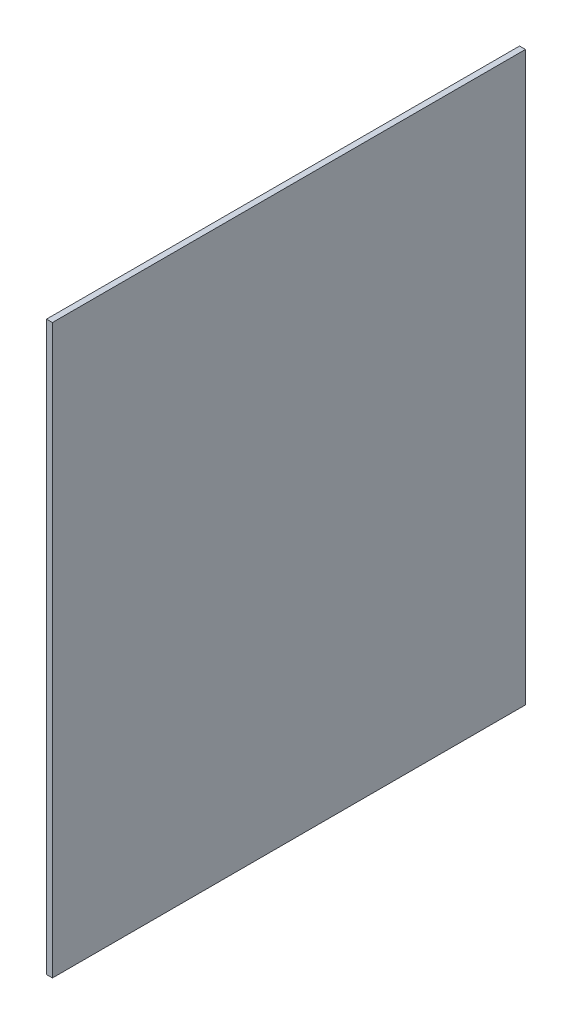
ISO-10303-21;
HEADER;
FILE_DESCRIPTION(('STEP AP214'),'2;1');
FILE_NAME('part.step','',(''),(''),'','','');
FILE_SCHEMA(('AUTOMOTIVE_DESIGN { 1 0 10303 214 1 1 1 1 }'));
ENDSEC;
DATA;
#1=APPLICATION_CONTEXT('core data for automotive mechanical design processes');
#2=APPLICATION_PROTOCOL_DEFINITION('international standard','automotive_design',2000,#1);
#3=PRODUCT_CONTEXT('',#1,'mechanical');
#4=PRODUCT('Part','Part','',(#3));
#5=PRODUCT_RELATED_PRODUCT_CATEGORY('part','',(#4));
#6=PRODUCT_DEFINITION_FORMATION('','',#4);
#7=PRODUCT_DEFINITION_CONTEXT('part definition',#1,'design');
#8=PRODUCT_DEFINITION('design','',#6,#7);
#9=PRODUCT_DEFINITION_SHAPE('','',#8);
#10=(LENGTH_UNIT() NAMED_UNIT(*) SI_UNIT(.MILLI.,.METRE.));
#11=(NAMED_UNIT(*) PLANE_ANGLE_UNIT() SI_UNIT($,.RADIAN.));
#12=(NAMED_UNIT(*) SI_UNIT($,.STERADIAN.) SOLID_ANGLE_UNIT());
#13=UNCERTAINTY_MEASURE_WITH_UNIT(LENGTH_MEASURE(1.E-05),#10,'distance_accuracy_value','');
#14=(GEOMETRIC_REPRESENTATION_CONTEXT(3) GLOBAL_UNCERTAINTY_ASSIGNED_CONTEXT((#13)) GLOBAL_UNIT_ASSIGNED_CONTEXT((#10,
#11,#12)) REPRESENTATION_CONTEXT('',''));
#15=CARTESIAN_POINT('',(0.,0.,0.));
#16=DIRECTION('',(0.,0.,1.));
#17=DIRECTION('',(1.,0.,0.));
#18=AXIS2_PLACEMENT_3D('',#15,#16,#17);
#19=CARTESIAN_POINT('',(6.35,0.,0.));
#20=DIRECTION('',(0.,0.,-1.));
#21=DIRECTION('',(0.,1.,0.));
#22=AXIS2_PLACEMENT_3D('',#19,#20,#21);
#23=PLANE('',#22);
#24=DIRECTION('',(0.,-1.,0.));
#25=VECTOR('',#24,1.);
#26=CARTESIAN_POINT('',(0.,0.,0.));
#27=LINE('',#26,#25);
#28=CARTESIAN_POINT('',(0.,0.,0.));
#29=VERTEX_POINT('',#28);
#30=CARTESIAN_POINT('',(0.,-609.6,-1.11022302462516E-13));
#31=VERTEX_POINT('',#30);
#32=EDGE_CURVE('E107',#29,#31,#27,.T.);
#33=ORIENTED_EDGE('',*,*,#32,.T.);
#34=DIRECTION('',(-1.,0.,0.));
#35=VECTOR('',#34,1.);
#36=CARTESIAN_POINT('',(6.35,-609.6,-1.11022302462516E-13));
#37=LINE('',#36,#35);
#38=CARTESIAN_POINT('',(6.35,-609.6,-1.11022302462516E-13));
#39=VERTEX_POINT('',#38);
#40=EDGE_CURVE('E11',#39,#31,#37,.T.);
#41=ORIENTED_EDGE('',*,*,#40,.F.);
#42=DIRECTION('',(0.,-1.,0.));
#43=VECTOR('',#42,1.);
#44=CARTESIAN_POINT('',(6.35,0.,0.));
#45=LINE('',#44,#43);
#46=CARTESIAN_POINT('',(6.35,0.,0.));
#47=VERTEX_POINT('',#46);
#48=EDGE_CURVE('E91',#47,#39,#45,.T.);
#49=ORIENTED_EDGE('',*,*,#48,.F.);
#50=DIRECTION('',(-1.,0.,0.));
#51=VECTOR('',#50,1.);
#52=CARTESIAN_POINT('',(6.35,0.,0.));
#53=LINE('',#52,#51);
#54=EDGE_CURVE('E103',#47,#29,#53,.T.);
#55=ORIENTED_EDGE('',*,*,#54,.T.);
#56=EDGE_LOOP('',(#33,#41,#49,#55));
#57=FACE_BOUND('',#56,.T.);
#58=ADVANCED_FACE('F39',(#57),#23,.F.);
#59=CARTESIAN_POINT('',(6.35,-609.6,-1.11022302462516E-13));
#60=DIRECTION('',(0.,1.,0.));
#61=DIRECTION('',(0.,0.,1.));
#62=AXIS2_PLACEMENT_3D('',#59,#60,#61);
#63=PLANE('',#62);
#64=DIRECTION('',(0.,0.,-1.));
#65=VECTOR('',#64,1.);
#66=CARTESIAN_POINT('',(0.,-609.6,-1.11022302462516E-13));
#67=LINE('',#66,#65);
#68=CARTESIAN_POINT('',(0.,-609.6,-508.));
#69=VERTEX_POINT('',#68);
#70=EDGE_CURVE('E96',#31,#69,#67,.T.);
#71=ORIENTED_EDGE('',*,*,#70,.T.);
#72=DIRECTION('',(-1.,0.,0.));
#73=VECTOR('',#72,1.);
#74=CARTESIAN_POINT('',(6.35,-609.6,-508.));
#75=LINE('',#74,#73);
#76=CARTESIAN_POINT('',(6.35,-609.6,-508.));
#77=VERTEX_POINT('',#76);
#78=EDGE_CURVE('E48',#77,#69,#75,.T.);
#79=ORIENTED_EDGE('',*,*,#78,.F.);
#80=DIRECTION('',(0.,0.,-1.));
#81=VECTOR('',#80,1.);
#82=CARTESIAN_POINT('',(6.35,-609.6,-1.11022302462516E-13));
#83=LINE('',#82,#81);
#84=EDGE_CURVE('E86',#39,#77,#83,.T.);
#85=ORIENTED_EDGE('',*,*,#84,.F.);
#86=ORIENTED_EDGE('',*,*,#40,.T.);
#87=EDGE_LOOP('',(#71,#79,#85,#86));
#88=FACE_BOUND('',#87,.T.);
#89=ADVANCED_FACE('F95',(#88),#63,.F.);
#90=CARTESIAN_POINT('',(6.35,0.,-508.));
#91=DIRECTION('',(0.,0.,1.));
#92=DIRECTION('',(0.,-1.,0.));
#93=AXIS2_PLACEMENT_3D('',#90,#91,#92);
#94=PLANE('',#93);
#95=DIRECTION('',(0.,1.,0.));
#96=VECTOR('',#95,1.);
#97=CARTESIAN_POINT('',(0.,0.,-508.));
#98=LINE('',#97,#96);
#99=CARTESIAN_POINT('',(0.,0.,-508.));
#100=VERTEX_POINT('',#99);
#101=EDGE_CURVE('E73',#69,#100,#98,.T.);
#102=ORIENTED_EDGE('',*,*,#101,.T.);
#103=DIRECTION('',(-1.,0.,0.));
#104=VECTOR('',#103,1.);
#105=CARTESIAN_POINT('',(6.35,0.,-508.));
#106=LINE('',#105,#104);
#107=CARTESIAN_POINT('',(6.35,0.,-508.));
#108=VERTEX_POINT('',#107);
#109=EDGE_CURVE('E98',#108,#100,#106,.T.);
#110=ORIENTED_EDGE('',*,*,#109,.F.);
#111=DIRECTION('',(0.,1.,0.));
#112=VECTOR('',#111,1.);
#113=CARTESIAN_POINT('',(6.35,0.,-508.));
#114=LINE('',#113,#112);
#115=EDGE_CURVE('E89',#77,#108,#114,.T.);
#116=ORIENTED_EDGE('',*,*,#115,.F.);
#117=ORIENTED_EDGE('',*,*,#78,.T.);
#118=EDGE_LOOP('',(#102,#110,#116,#117));
#119=FACE_BOUND('',#118,.T.);
#120=ADVANCED_FACE('F99',(#119),#94,.F.);
#121=CARTESIAN_POINT('',(6.35,0.,0.));
#122=DIRECTION('',(0.,-1.,0.));
#123=DIRECTION('',(0.,0.,-1.));
#124=AXIS2_PLACEMENT_3D('',#121,#122,#123);
#125=PLANE('',#124);
#126=DIRECTION('',(0.,0.,1.));
#127=VECTOR('',#126,1.);
#128=CARTESIAN_POINT('',(0.,0.,0.));
#129=LINE('',#128,#127);
#130=EDGE_CURVE('E79',#100,#29,#129,.T.);
#131=ORIENTED_EDGE('',*,*,#130,.T.);
#132=ORIENTED_EDGE('',*,*,#54,.F.);
#133=DIRECTION('',(0.,0.,1.));
#134=VECTOR('',#133,1.);
#135=CARTESIAN_POINT('',(6.35,0.,0.));
#136=LINE('',#135,#134);
#137=EDGE_CURVE('E56',#108,#47,#136,.T.);
#138=ORIENTED_EDGE('',*,*,#137,.F.);
#139=ORIENTED_EDGE('',*,*,#109,.T.);
#140=EDGE_LOOP('',(#131,#132,#138,#139));
#141=FACE_BOUND('',#140,.T.);
#142=ADVANCED_FACE('F120',(#141),#125,.F.);
#143=CARTESIAN_POINT('',(6.35,0.,0.));
#144=DIRECTION('',(1.,0.,0.));
#145=DIRECTION('',(0.,0.,-1.));
#146=AXIS2_PLACEMENT_3D('',#143,#144,#145);
#147=PLANE('',#146);
#148=ORIENTED_EDGE('',*,*,#48,.T.);
#149=ORIENTED_EDGE('',*,*,#84,.T.);
#150=ORIENTED_EDGE('',*,*,#115,.T.);
#151=ORIENTED_EDGE('',*,*,#137,.T.);
#152=EDGE_LOOP('',(#148,#149,#150,#151));
#153=FACE_BOUND('',#152,.T.);
#154=ADVANCED_FACE('F87',(#153),#147,.T.);
#155=CARTESIAN_POINT('',(0.,0.,0.));
#156=DIRECTION('',(1.,0.,0.));
#157=DIRECTION('',(0.,0.,-1.));
#158=AXIS2_PLACEMENT_3D('',#155,#156,#157);
#159=PLANE('',#158);
#160=ORIENTED_EDGE('',*,*,#32,.F.);
#161=ORIENTED_EDGE('',*,*,#130,.F.);
#162=ORIENTED_EDGE('',*,*,#101,.F.);
#163=ORIENTED_EDGE('',*,*,#70,.F.);
#164=EDGE_LOOP('',(#160,#161,#162,#163));
#165=FACE_BOUND('',#164,.T.);
#166=ADVANCED_FACE('F123',(#165),#159,.F.);
#167=CLOSED_SHELL('',(#58,#89,#120,#142,#154,#166));
#168=MANIFOLD_SOLID_BREP('B2',#167);
#169=ADVANCED_BREP_SHAPE_REPRESENTATION('',(#18,#168),#14);
#170=SHAPE_DEFINITION_REPRESENTATION(#9,#169);
ENDSEC;
END-ISO-10303-21;
